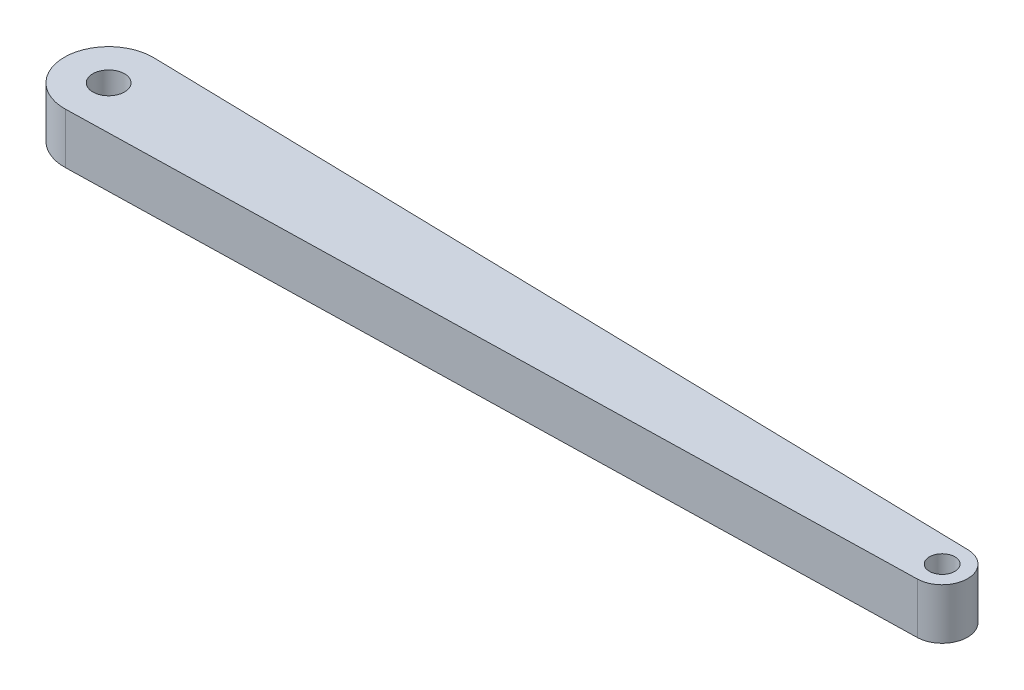
ISO-10303-21;
HEADER;
FILE_DESCRIPTION(('STEP AP214'),'2;1');
FILE_NAME('part.step','',(''),(''),'','','');
FILE_SCHEMA(('AUTOMOTIVE_DESIGN { 1 0 10303 214 1 1 1 1 }'));
ENDSEC;
DATA;
#1=APPLICATION_CONTEXT('core data for automotive mechanical design processes');
#2=APPLICATION_PROTOCOL_DEFINITION('international standard','automotive_design',2000,#1);
#3=PRODUCT_CONTEXT('',#1,'mechanical');
#4=PRODUCT('Part','Part','',(#3));
#5=PRODUCT_RELATED_PRODUCT_CATEGORY('part','',(#4));
#6=PRODUCT_DEFINITION_FORMATION('','',#4);
#7=PRODUCT_DEFINITION_CONTEXT('part definition',#1,'design');
#8=PRODUCT_DEFINITION('design','',#6,#7);
#9=PRODUCT_DEFINITION_SHAPE('','',#8);
#10=(LENGTH_UNIT() NAMED_UNIT(*) SI_UNIT(.MILLI.,.METRE.));
#11=(NAMED_UNIT(*) PLANE_ANGLE_UNIT() SI_UNIT($,.RADIAN.));
#12=(NAMED_UNIT(*) SI_UNIT($,.STERADIAN.) SOLID_ANGLE_UNIT());
#13=UNCERTAINTY_MEASURE_WITH_UNIT(LENGTH_MEASURE(1.E-05),#10,'distance_accuracy_value','');
#14=(GEOMETRIC_REPRESENTATION_CONTEXT(3) GLOBAL_UNCERTAINTY_ASSIGNED_CONTEXT((#13)) GLOBAL_UNIT_ASSIGNED_CONTEXT((#10,
#11,#12)) REPRESENTATION_CONTEXT('',''));
#15=CARTESIAN_POINT('',(0.,0.,0.));
#16=DIRECTION('',(0.,0.,1.));
#17=DIRECTION('',(1.,0.,0.));
#18=AXIS2_PLACEMENT_3D('',#15,#16,#17);
#19=CARTESIAN_POINT('',(0.,40.,0.));
#20=DIRECTION('',(0.,1.,0.));
#21=DIRECTION('',(0.,0.,1.));
#22=AXIS2_PLACEMENT_3D('',#19,#20,#21);
#23=PLANE('',#22);
#24=CARTESIAN_POINT('',(0.,40.,0.));
#25=DIRECTION('',(0.,1.,0.));
#26=DIRECTION('',(0.,0.,1.));
#27=AXIS2_PLACEMENT_3D('',#24,#25,#26);
#28=CIRCLE('',#27,25.);
#29=CARTESIAN_POINT('',(0.,40.,25.));
#30=VERTEX_POINT('',#29);
#31=EDGE_CURVE('E112',#30,#30,#28,.T.);
#32=ORIENTED_EDGE('',*,*,#31,.F.);
#33=EDGE_LOOP('',(#32));
#34=FACE_BOUND('',#33,.T.);
#35=CARTESIAN_POINT('',(0.,40.,0.));
#36=DIRECTION('',(0.,1.,0.));
#37=DIRECTION('',(0.,0.,1.));
#38=AXIS2_PLACEMENT_3D('',#35,#36,#37);
#39=CIRCLE('',#38,70.);
#40=CARTESIAN_POINT('',(1.59695817490494,40.,-69.9817813762096));
#41=VERTEX_POINT('',#40);
#42=CARTESIAN_POINT('',(1.59695817490494,40.,69.9817813762096));
#43=VERTEX_POINT('',#42);
#44=EDGE_CURVE('E92',#41,#43,#39,.T.);
#45=ORIENTED_EDGE('',*,*,#44,.T.);
#46=DIRECTION('',(0.999739733945852,0.,-0.0228136882129277));
#47=VECTOR('',#46,1.);
#48=CARTESIAN_POINT('',(1.59695817490494,40.,69.9817813762096));
#49=LINE('',#48,#47);
#50=CARTESIAN_POINT('',(1315.91254752852,40.,39.9895893578341));
#51=VERTEX_POINT('',#50);
#52=EDGE_CURVE('E87',#43,#51,#49,.T.);
#53=ORIENTED_EDGE('',*,*,#52,.T.);
#54=CARTESIAN_POINT('',(1315.,40.,0.));
#55=DIRECTION('',(0.,1.,0.));
#56=DIRECTION('',(0.,0.,1.));
#57=AXIS2_PLACEMENT_3D('',#54,#55,#56);
#58=CIRCLE('',#57,40.);
#59=CARTESIAN_POINT('',(1315.91254752852,40.,-39.9895893578341));
#60=VERTEX_POINT('',#59);
#61=EDGE_CURVE('E90',#51,#60,#58,.T.);
#62=ORIENTED_EDGE('',*,*,#61,.T.);
#63=DIRECTION('',(-0.999739733945852,0.,-0.0228136882129277));
#64=VECTOR('',#63,1.);
#65=CARTESIAN_POINT('',(1.59695817490494,40.,-69.9817813762096));
#66=LINE('',#65,#64);
#67=EDGE_CURVE('E57',#60,#41,#66,.T.);
#68=ORIENTED_EDGE('',*,*,#67,.T.);
#69=EDGE_LOOP('',(#45,#53,#62,#68));
#70=FACE_BOUND('',#69,.T.);
#71=CARTESIAN_POINT('',(1315.,40.,0.));
#72=DIRECTION('',(0.,1.,0.));
#73=DIRECTION('',(0.,0.,1.));
#74=AXIS2_PLACEMENT_3D('',#71,#72,#73);
#75=CIRCLE('',#74,20.);
#76=CARTESIAN_POINT('',(1315.,40.,20.));
#77=VERTEX_POINT('',#76);
#78=EDGE_CURVE('E134',#77,#77,#75,.T.);
#79=ORIENTED_EDGE('',*,*,#78,.F.);
#80=EDGE_LOOP('',(#79));
#81=FACE_BOUND('',#80,.T.);
#82=ADVANCED_FACE('F39',(#34,#70,#81),#23,.T.);
#83=CARTESIAN_POINT('',(0.,-40.,0.));
#84=DIRECTION('',(0.,1.,0.));
#85=DIRECTION('',(0.,0.,1.));
#86=AXIS2_PLACEMENT_3D('',#83,#84,#85);
#87=PLANE('',#86);
#88=CARTESIAN_POINT('',(0.,-40.,0.));
#89=DIRECTION('',(0.,1.,0.));
#90=DIRECTION('',(0.,0.,1.));
#91=AXIS2_PLACEMENT_3D('',#88,#89,#90);
#92=CIRCLE('',#91,70.);
#93=CARTESIAN_POINT('',(1.59695817490494,-40.,-69.9817813762096));
#94=VERTEX_POINT('',#93);
#95=CARTESIAN_POINT('',(1.59695817490494,-40.,69.9817813762096));
#96=VERTEX_POINT('',#95);
#97=EDGE_CURVE('E108',#94,#96,#92,.T.);
#98=ORIENTED_EDGE('',*,*,#97,.F.);
#99=DIRECTION('',(-0.999739733945852,0.,-0.0228136882129277));
#100=VECTOR('',#99,1.);
#101=CARTESIAN_POINT('',(1.59695817490494,-40.,-69.9817813762096));
#102=LINE('',#101,#100);
#103=CARTESIAN_POINT('',(1315.91254752852,-40.,-39.9895893578341));
#104=VERTEX_POINT('',#103);
#105=EDGE_CURVE('E80',#104,#94,#102,.T.);
#106=ORIENTED_EDGE('',*,*,#105,.F.);
#107=CARTESIAN_POINT('',(1315.,-40.,0.));
#108=DIRECTION('',(0.,1.,0.));
#109=DIRECTION('',(0.,0.,1.));
#110=AXIS2_PLACEMENT_3D('',#107,#108,#109);
#111=CIRCLE('',#110,40.);
#112=CARTESIAN_POINT('',(1315.91254752852,-40.,39.9895893578341));
#113=VERTEX_POINT('',#112);
#114=EDGE_CURVE('E74',#113,#104,#111,.T.);
#115=ORIENTED_EDGE('',*,*,#114,.F.);
#116=DIRECTION('',(0.999739733945852,0.,-0.0228136882129277));
#117=VECTOR('',#116,1.);
#118=CARTESIAN_POINT('',(1.59695817490494,-40.,69.9817813762096));
#119=LINE('',#118,#117);
#120=EDGE_CURVE('E97',#96,#113,#119,.T.);
#121=ORIENTED_EDGE('',*,*,#120,.F.);
#122=EDGE_LOOP('',(#98,#106,#115,#121));
#123=FACE_BOUND('',#122,.T.);
#124=CARTESIAN_POINT('',(0.,-40.,0.));
#125=DIRECTION('',(0.,1.,0.));
#126=DIRECTION('',(0.,0.,1.));
#127=AXIS2_PLACEMENT_3D('',#124,#125,#126);
#128=CIRCLE('',#127,25.);
#129=CARTESIAN_POINT('',(0.,-40.,25.));
#130=VERTEX_POINT('',#129);
#131=EDGE_CURVE('E130',#130,#130,#128,.T.);
#132=ORIENTED_EDGE('',*,*,#131,.T.);
#133=EDGE_LOOP('',(#132));
#134=FACE_BOUND('',#133,.T.);
#135=CARTESIAN_POINT('',(1315.,-40.,0.));
#136=DIRECTION('',(0.,1.,0.));
#137=DIRECTION('',(0.,0.,1.));
#138=AXIS2_PLACEMENT_3D('',#135,#136,#137);
#139=CIRCLE('',#138,20.);
#140=CARTESIAN_POINT('',(1315.,-40.,20.));
#141=VERTEX_POINT('',#140);
#142=EDGE_CURVE('E138',#141,#141,#139,.T.);
#143=ORIENTED_EDGE('',*,*,#142,.T.);
#144=EDGE_LOOP('',(#143));
#145=FACE_BOUND('',#144,.T.);
#146=ADVANCED_FACE('F125',(#123,#134,#145),#87,.F.);
#147=CARTESIAN_POINT('',(0.,40.,0.));
#148=DIRECTION('',(0.,-1.,0.));
#149=DIRECTION('',(0.,0.,-1.));
#150=AXIS2_PLACEMENT_3D('',#147,#148,#149);
#151=CYLINDRICAL_SURFACE('',#150,70.);
#152=ORIENTED_EDGE('',*,*,#97,.T.);
#153=DIRECTION('',(0.,-1.,0.));
#154=VECTOR('',#153,1.);
#155=CARTESIAN_POINT('',(1.59695817490494,40.,69.9817813762096));
#156=LINE('',#155,#154);
#157=EDGE_CURVE('E11',#43,#96,#156,.T.);
#158=ORIENTED_EDGE('',*,*,#157,.F.);
#159=ORIENTED_EDGE('',*,*,#44,.F.);
#160=DIRECTION('',(0.,-1.,0.));
#161=VECTOR('',#160,1.);
#162=CARTESIAN_POINT('',(1.59695817490494,40.,-69.9817813762096));
#163=LINE('',#162,#161);
#164=EDGE_CURVE('E104',#41,#94,#163,.T.);
#165=ORIENTED_EDGE('',*,*,#164,.T.);
#166=EDGE_LOOP('',(#152,#158,#159,#165));
#167=FACE_BOUND('',#166,.T.);
#168=ADVANCED_FACE('F41',(#167),#151,.T.);
#169=CARTESIAN_POINT('',(1.59695817490494,40.,69.9817813762096));
#170=DIRECTION('',(-0.0228136882129277,0.,-0.999739733945852));
#171=DIRECTION('',(-0.999739733945852,0.,0.0228136882129277));
#172=AXIS2_PLACEMENT_3D('',#169,#170,#171);
#173=PLANE('',#172);
#174=ORIENTED_EDGE('',*,*,#120,.T.);
#175=DIRECTION('',(0.,-1.,0.));
#176=VECTOR('',#175,1.);
#177=CARTESIAN_POINT('',(1315.91254752852,40.,39.9895893578341));
#178=LINE('',#177,#176);
#179=EDGE_CURVE('E49',#51,#113,#178,.T.);
#180=ORIENTED_EDGE('',*,*,#179,.F.);
#181=ORIENTED_EDGE('',*,*,#52,.F.);
#182=ORIENTED_EDGE('',*,*,#157,.T.);
#183=EDGE_LOOP('',(#174,#180,#181,#182));
#184=FACE_BOUND('',#183,.T.);
#185=ADVANCED_FACE('F96',(#184),#173,.F.);
#186=CARTESIAN_POINT('',(1315.,40.,0.));
#187=DIRECTION('',(0.,-1.,0.));
#188=DIRECTION('',(0.,0.,-1.));
#189=AXIS2_PLACEMENT_3D('',#186,#187,#188);
#190=CYLINDRICAL_SURFACE('',#189,40.);
#191=ORIENTED_EDGE('',*,*,#114,.T.);
#192=DIRECTION('',(0.,-1.,0.));
#193=VECTOR('',#192,1.);
#194=CARTESIAN_POINT('',(1315.91254752852,40.,-39.9895893578341));
#195=LINE('',#194,#193);
#196=EDGE_CURVE('E99',#60,#104,#195,.T.);
#197=ORIENTED_EDGE('',*,*,#196,.F.);
#198=ORIENTED_EDGE('',*,*,#61,.F.);
#199=ORIENTED_EDGE('',*,*,#179,.T.);
#200=EDGE_LOOP('',(#191,#197,#198,#199));
#201=FACE_BOUND('',#200,.T.);
#202=ADVANCED_FACE('F100',(#201),#190,.T.);
#203=CARTESIAN_POINT('',(1.59695817490494,40.,-69.9817813762096));
#204=DIRECTION('',(-0.0228136882129277,0.,0.999739733945852));
#205=DIRECTION('',(0.999739733945852,0.,0.0228136882129277));
#206=AXIS2_PLACEMENT_3D('',#203,#204,#205);
#207=PLANE('',#206);
#208=ORIENTED_EDGE('',*,*,#105,.T.);
#209=ORIENTED_EDGE('',*,*,#164,.F.);
#210=ORIENTED_EDGE('',*,*,#67,.F.);
#211=ORIENTED_EDGE('',*,*,#196,.T.);
#212=EDGE_LOOP('',(#208,#209,#210,#211));
#213=FACE_BOUND('',#212,.T.);
#214=ADVANCED_FACE('F122',(#213),#207,.F.);
#215=CARTESIAN_POINT('',(0.,40.,0.));
#216=DIRECTION('',(0.,-1.,0.));
#217=DIRECTION('',(0.,0.,-1.));
#218=AXIS2_PLACEMENT_3D('',#215,#216,#217);
#219=CYLINDRICAL_SURFACE('',#218,25.);
#220=ORIENTED_EDGE('',*,*,#31,.T.);
#221=EDGE_LOOP('',(#220));
#222=FACE_BOUND('',#221,.T.);
#223=ORIENTED_EDGE('',*,*,#131,.F.);
#224=EDGE_LOOP('',(#223));
#225=FACE_BOUND('',#224,.T.);
#226=ADVANCED_FACE('F157',(#222,#225),#219,.F.);
#227=CARTESIAN_POINT('',(1315.,40.,0.));
#228=DIRECTION('',(0.,-1.,0.));
#229=DIRECTION('',(0.,0.,-1.));
#230=AXIS2_PLACEMENT_3D('',#227,#228,#229);
#231=CYLINDRICAL_SURFACE('',#230,20.);
#232=ORIENTED_EDGE('',*,*,#78,.T.);
#233=EDGE_LOOP('',(#232));
#234=FACE_BOUND('',#233,.T.);
#235=ORIENTED_EDGE('',*,*,#142,.F.);
#236=EDGE_LOOP('',(#235));
#237=FACE_BOUND('',#236,.T.);
#238=ADVANCED_FACE('F146',(#234,#237),#231,.F.);
#239=CLOSED_SHELL('',(#82,#146,#168,#185,#202,#214,#226,#238));
#240=MANIFOLD_SOLID_BREP('B2',#239);
#241=ADVANCED_BREP_SHAPE_REPRESENTATION('',(#18,#240),#14);
#242=SHAPE_DEFINITION_REPRESENTATION(#9,#241);
ENDSEC;
END-ISO-10303-21;
